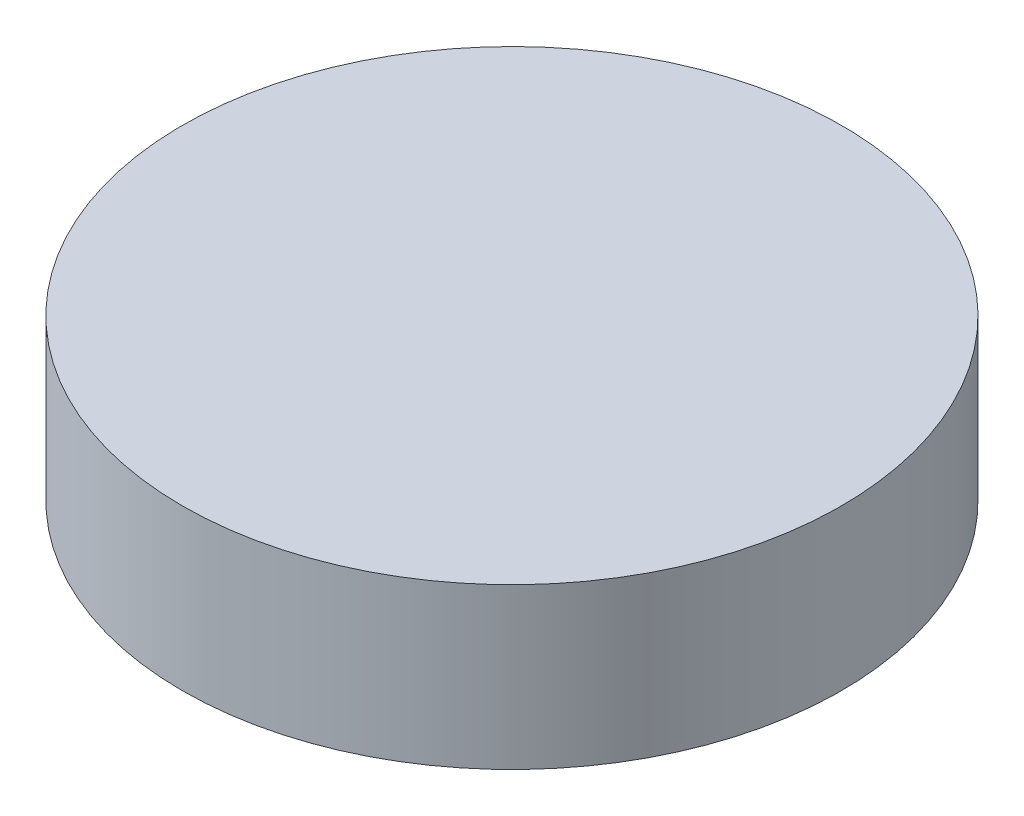
ISO-10303-21;
HEADER;
FILE_DESCRIPTION(('STEP AP214'),'2;1');
FILE_NAME('part.step','',(''),(''),'','','');
FILE_SCHEMA(('AUTOMOTIVE_DESIGN { 1 0 10303 214 1 1 1 1 }'));
ENDSEC;
DATA;
#1=APPLICATION_CONTEXT('core data for automotive mechanical design processes');
#2=APPLICATION_PROTOCOL_DEFINITION('international standard','automotive_design',2000,#1);
#3=PRODUCT_CONTEXT('',#1,'mechanical');
#4=PRODUCT('Part','Part','',(#3));
#5=PRODUCT_RELATED_PRODUCT_CATEGORY('part','',(#4));
#6=PRODUCT_DEFINITION_FORMATION('','',#4);
#7=PRODUCT_DEFINITION_CONTEXT('part definition',#1,'design');
#8=PRODUCT_DEFINITION('design','',#6,#7);
#9=PRODUCT_DEFINITION_SHAPE('','',#8);
#10=(LENGTH_UNIT() NAMED_UNIT(*) SI_UNIT(.MILLI.,.METRE.));
#11=(NAMED_UNIT(*) PLANE_ANGLE_UNIT() SI_UNIT($,.RADIAN.));
#12=(NAMED_UNIT(*) SI_UNIT($,.STERADIAN.) SOLID_ANGLE_UNIT());
#13=UNCERTAINTY_MEASURE_WITH_UNIT(LENGTH_MEASURE(1.E-05),#10,'distance_accuracy_value','');
#14=(GEOMETRIC_REPRESENTATION_CONTEXT(3) GLOBAL_UNCERTAINTY_ASSIGNED_CONTEXT((#13)) GLOBAL_UNIT_ASSIGNED_CONTEXT((#10,
#11,#12)) REPRESENTATION_CONTEXT('',''));
#15=CARTESIAN_POINT('',(0.,0.,0.));
#16=DIRECTION('',(0.,0.,1.));
#17=DIRECTION('',(1.,0.,0.));
#18=AXIS2_PLACEMENT_3D('',#15,#16,#17);
#19=CARTESIAN_POINT('',(0.,10.,0.));
#20=DIRECTION('',(0.,-1.,0.));
#21=DIRECTION('',(0.,0.,-1.));
#22=AXIS2_PLACEMENT_3D('',#19,#20,#21);
#23=CYLINDRICAL_SURFACE('',#22,20.59);
#24=CARTESIAN_POINT('',(0.,10.,0.));
#25=DIRECTION('',(0.,1.,0.));
#26=DIRECTION('',(0.,0.,1.));
#27=AXIS2_PLACEMENT_3D('',#24,#25,#26);
#28=CIRCLE('',#27,20.59);
#29=CARTESIAN_POINT('',(0.,10.,20.59));
#30=VERTEX_POINT('',#29);
#31=EDGE_CURVE('E10',#30,#30,#28,.T.);
#32=ORIENTED_EDGE('',*,*,#31,.F.);
#33=EDGE_LOOP('',(#32));
#34=FACE_BOUND('',#33,.T.);
#35=CARTESIAN_POINT('',(0.,0.,0.));
#36=DIRECTION('',(0.,1.,0.));
#37=DIRECTION('',(0.,0.,1.));
#38=AXIS2_PLACEMENT_3D('',#35,#36,#37);
#39=CIRCLE('',#38,20.59);
#40=CARTESIAN_POINT('',(0.,0.,20.59));
#41=VERTEX_POINT('',#40);
#42=EDGE_CURVE('E36',#41,#41,#39,.T.);
#43=ORIENTED_EDGE('',*,*,#42,.T.);
#44=EDGE_LOOP('',(#43));
#45=FACE_BOUND('',#44,.T.);
#46=ADVANCED_FACE('F33',(#34,#45),#23,.T.);
#47=CARTESIAN_POINT('',(0.,10.,0.));
#48=DIRECTION('',(0.,1.,0.));
#49=DIRECTION('',(0.,0.,1.));
#50=AXIS2_PLACEMENT_3D('',#47,#48,#49);
#51=PLANE('',#50);
#52=ORIENTED_EDGE('',*,*,#31,.T.);
#53=EDGE_LOOP('',(#52));
#54=FACE_BOUND('',#53,.T.);
#55=ADVANCED_FACE('F48',(#54),#51,.T.);
#56=CARTESIAN_POINT('',(0.,0.,0.));
#57=DIRECTION('',(0.,1.,0.));
#58=DIRECTION('',(0.,0.,1.));
#59=AXIS2_PLACEMENT_3D('',#56,#57,#58);
#60=PLANE('',#59);
#61=ORIENTED_EDGE('',*,*,#42,.F.);
#62=EDGE_LOOP('',(#61));
#63=FACE_BOUND('',#62,.T.);
#64=ADVANCED_FACE('F46',(#63),#60,.F.);
#65=CLOSED_SHELL('',(#46,#55,#64));
#66=MANIFOLD_SOLID_BREP('B2',#65);
#67=ADVANCED_BREP_SHAPE_REPRESENTATION('',(#18,#66),#14);
#68=SHAPE_DEFINITION_REPRESENTATION(#9,#67);
ENDSEC;
END-ISO-10303-21;
